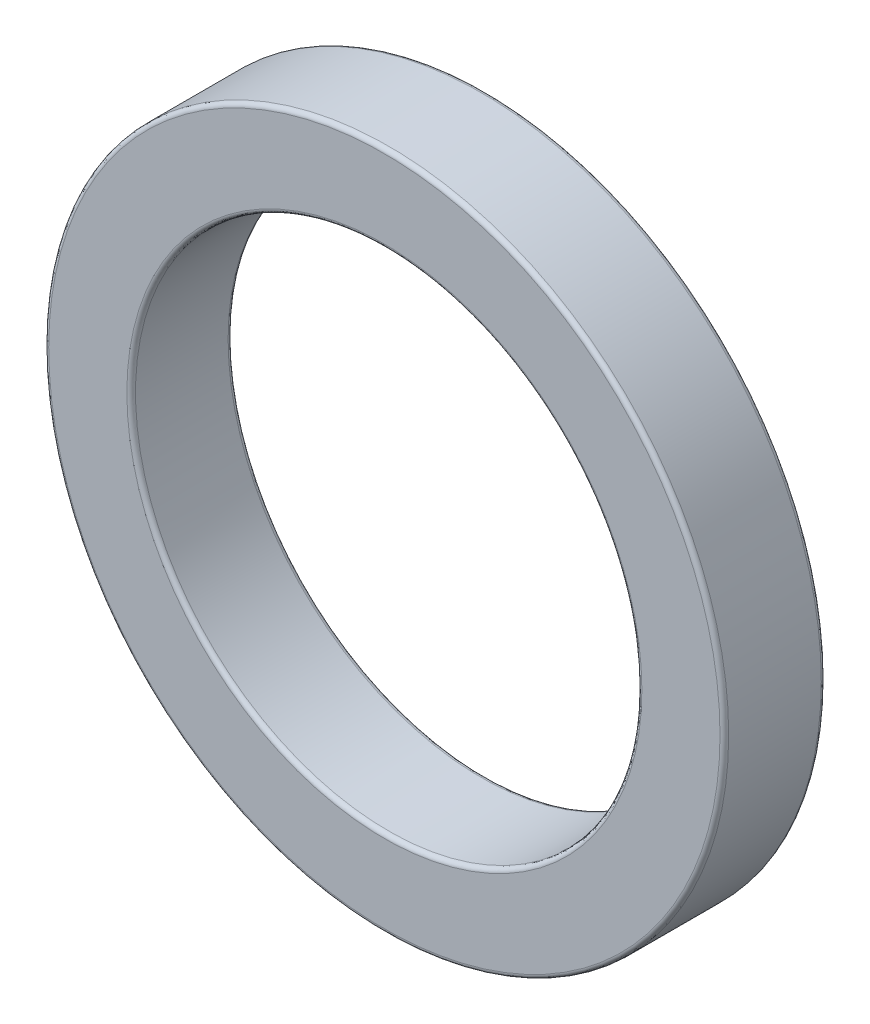
ISO-10303-21;
HEADER;
FILE_DESCRIPTION(('STEP AP214'),'2;1');
FILE_NAME('part.step','',(''),(''),'','','');
FILE_SCHEMA(('AUTOMOTIVE_DESIGN { 1 0 10303 214 1 1 1 1 }'));
ENDSEC;
DATA;
#1=APPLICATION_CONTEXT('core data for automotive mechanical design processes');
#2=APPLICATION_PROTOCOL_DEFINITION('international standard','automotive_design',2000,#1);
#3=PRODUCT_CONTEXT('',#1,'mechanical');
#4=PRODUCT('Part','Part','',(#3));
#5=PRODUCT_RELATED_PRODUCT_CATEGORY('part','',(#4));
#6=PRODUCT_DEFINITION_FORMATION('','',#4);
#7=PRODUCT_DEFINITION_CONTEXT('part definition',#1,'design');
#8=PRODUCT_DEFINITION('design','',#6,#7);
#9=PRODUCT_DEFINITION_SHAPE('','',#8);
#10=(LENGTH_UNIT() NAMED_UNIT(*) SI_UNIT(.MILLI.,.METRE.));
#11=(NAMED_UNIT(*) PLANE_ANGLE_UNIT() SI_UNIT($,.RADIAN.));
#12=(NAMED_UNIT(*) SI_UNIT($,.STERADIAN.) SOLID_ANGLE_UNIT());
#13=UNCERTAINTY_MEASURE_WITH_UNIT(LENGTH_MEASURE(1.E-05),#10,'distance_accuracy_value','');
#14=(GEOMETRIC_REPRESENTATION_CONTEXT(3) GLOBAL_UNCERTAINTY_ASSIGNED_CONTEXT((#13)) GLOBAL_UNIT_ASSIGNED_CONTEXT((#10,
#11,#12)) REPRESENTATION_CONTEXT('',''));
#15=CARTESIAN_POINT('',(0.,0.,0.));
#16=DIRECTION('',(0.,0.,1.));
#17=DIRECTION('',(1.,0.,0.));
#18=AXIS2_PLACEMENT_3D('',#15,#16,#17);
#19=CARTESIAN_POINT('',(23.5,0.,0.3));
#20=CARTESIAN_POINT('',(23.5,0.,0.124264068711928));
#21=CARTESIAN_POINT('',(23.3757359312881,0.,0.));
#22=CARTESIAN_POINT('',(23.2,0.,0.));
#23=(BOUNDED_CURVE() B_SPLINE_CURVE(3,(#19,#20,#21,#22),.UNSPECIFIED.,.F.,
.F.) B_SPLINE_CURVE_WITH_KNOTS((4,4),(0.,1.),
.UNSPECIFIED.) CURVE() GEOMETRIC_REPRESENTATION_ITEM() RATIONAL_B_SPLINE_CURVE((1.,
0.804737854124365,0.804737854124365,1.)) REPRESENTATION_ITEM(''));
#24=CARTESIAN_POINT('',(0.,0.,0.3));
#25=DIRECTION('',(0.,0.,1.));
#26=AXIS1_PLACEMENT('',#24,#25);
#27=SURFACE_OF_REVOLUTION('',#23,#26);
#28=CARTESIAN_POINT('',(0.,0.,0.3));
#29=DIRECTION('',(0.,0.,-1.));
#30=DIRECTION('',(-1.,0.,0.));
#31=AXIS2_PLACEMENT_3D('',#28,#29,#30);
#32=CIRCLE('',#31,23.5);
#33=CARTESIAN_POINT('',(-23.5,0.,0.3));
#34=VERTEX_POINT('',#33);
#35=EDGE_CURVE('E68',#34,#34,#32,.F.);
#36=ORIENTED_EDGE('',*,*,#35,.F.);
#37=EDGE_LOOP('',(#36));
#38=FACE_BOUND('',#37,.T.);
#39=CARTESIAN_POINT('',(0.,0.,0.));
#40=DIRECTION('',(0.,0.,1.));
#41=DIRECTION('',(1.,0.,0.));
#42=AXIS2_PLACEMENT_3D('',#39,#40,#41);
#43=CIRCLE('',#42,23.2);
#44=CARTESIAN_POINT('',(-23.2,0.,0.));
#45=VERTEX_POINT('',#44);
#46=CARTESIAN_POINT('',(23.2,0.,0.));
#47=VERTEX_POINT('',#46);
#48=EDGE_CURVE('E60',#45,#47,#43,.F.);
#49=ORIENTED_EDGE('',*,*,#48,.F.);
#50=CARTESIAN_POINT('',(0.,0.,0.));
#51=DIRECTION('',(0.,0.,1.));
#52=DIRECTION('',(-1.,0.,0.));
#53=AXIS2_PLACEMENT_3D('',#50,#51,#52);
#54=CIRCLE('',#53,23.2);
#55=EDGE_CURVE('E58',#47,#45,#54,.F.);
#56=ORIENTED_EDGE('',*,*,#55,.F.);
#57=EDGE_LOOP('',(#49,#56));
#58=FACE_BOUND('',#57,.T.);
#59=ADVANCED_FACE('F17',(#38,#58),#27,.F.);
#60=CARTESIAN_POINT('',(0.,0.,0.3));
#61=DIRECTION('',(0.,0.,-1.));
#62=DIRECTION('',(-1.,0.,0.));
#63=AXIS2_PLACEMENT_3D('',#60,#61,#62);
#64=CYLINDRICAL_SURFACE('',#63,23.5);
#65=CARTESIAN_POINT('',(0.,0.,6.7));
#66=DIRECTION('',(0.,0.,1.));
#67=DIRECTION('',(1.,0.,0.));
#68=AXIS2_PLACEMENT_3D('',#65,#66,#67);
#69=CIRCLE('',#68,23.5);
#70=CARTESIAN_POINT('',(23.5,0.,6.7));
#71=VERTEX_POINT('',#70);
#72=EDGE_CURVE('E298',#71,#71,#69,.T.);
#73=ORIENTED_EDGE('',*,*,#72,.F.);
#74=EDGE_LOOP('',(#73));
#75=FACE_BOUND('',#74,.T.);
#76=ORIENTED_EDGE('',*,*,#35,.T.);
#77=EDGE_LOOP('',(#76));
#78=FACE_BOUND('',#77,.T.);
#79=ADVANCED_FACE('F87',(#75,#78),#64,.T.);
#80=CARTESIAN_POINT('',(0.,0.,0.));
#81=DIRECTION('',(0.,0.,1.));
#82=DIRECTION('',(1.,0.,0.));
#83=AXIS2_PLACEMENT_3D('',#80,#81,#82);
#84=PLANE('',#83);
#85=CARTESIAN_POINT('',(0.,0.,0.));
#86=DIRECTION('',(0.,0.,-1.));
#87=DIRECTION('',(-1.,0.,0.));
#88=AXIS2_PLACEMENT_3D('',#85,#86,#87);
#89=CIRCLE('',#88,17.8);
#90=CARTESIAN_POINT('',(-17.8,0.,0.));
#91=VERTEX_POINT('',#90);
#92=CARTESIAN_POINT('',(17.8,0.,0.));
#93=VERTEX_POINT('',#92);
#94=EDGE_CURVE('E120',#91,#93,#89,.T.);
#95=ORIENTED_EDGE('',*,*,#94,.F.);
#96=CARTESIAN_POINT('',(0.,0.,0.));
#97=DIRECTION('',(0.,0.,-1.));
#98=DIRECTION('',(1.,0.,0.));
#99=AXIS2_PLACEMENT_3D('',#96,#97,#98);
#100=CIRCLE('',#99,17.8);
#101=EDGE_CURVE('E64',#91,#93,#100,.F.);
#102=ORIENTED_EDGE('',*,*,#101,.T.);
#103=EDGE_LOOP('',(#95,#102));
#104=FACE_BOUND('',#103,.T.);
#105=ORIENTED_EDGE('',*,*,#55,.T.);
#106=ORIENTED_EDGE('',*,*,#48,.T.);
#107=EDGE_LOOP('',(#105,#106));
#108=FACE_BOUND('',#107,.T.);
#109=ADVANCED_FACE('F67',(#104,#108),#84,.F.);
#110=CARTESIAN_POINT('',(23.2,0.,7.));
#111=CARTESIAN_POINT('',(23.3757359312881,0.,7.));
#112=CARTESIAN_POINT('',(23.5,0.,6.87573593128807));
#113=CARTESIAN_POINT('',(23.5,0.,6.7));
#114=(BOUNDED_CURVE() B_SPLINE_CURVE(3,(#110,#111,#112,#113),.UNSPECIFIED.,.F.,
.F.) B_SPLINE_CURVE_WITH_KNOTS((4,4),(0.,1.),
.UNSPECIFIED.) CURVE() GEOMETRIC_REPRESENTATION_ITEM() RATIONAL_B_SPLINE_CURVE((1.,
0.804737854124365,0.804737854124365,1.)) REPRESENTATION_ITEM(''));
#115=CARTESIAN_POINT('',(0.,0.,6.7));
#116=DIRECTION('',(0.,0.,1.));
#117=AXIS1_PLACEMENT('',#115,#116);
#118=SURFACE_OF_REVOLUTION('',#114,#117);
#119=ORIENTED_EDGE('',*,*,#72,.T.);
#120=EDGE_LOOP('',(#119));
#121=FACE_BOUND('',#120,.T.);
#122=CARTESIAN_POINT('',(0.,0.,7.));
#123=DIRECTION('',(0.,0.,-1.));
#124=DIRECTION('',(1.,0.,0.));
#125=AXIS2_PLACEMENT_3D('',#122,#123,#124);
#126=CIRCLE('',#125,23.2);
#127=CARTESIAN_POINT('',(-23.2,0.,7.));
#128=VERTEX_POINT('',#127);
#129=CARTESIAN_POINT('',(23.2,0.,7.));
#130=VERTEX_POINT('',#129);
#131=EDGE_CURVE('E158',#128,#130,#126,.F.);
#132=ORIENTED_EDGE('',*,*,#131,.F.);
#133=CARTESIAN_POINT('',(0.,0.,7.));
#134=DIRECTION('',(0.,0.,-1.));
#135=DIRECTION('',(-1.,0.,0.));
#136=AXIS2_PLACEMENT_3D('',#133,#134,#135);
#137=CIRCLE('',#136,23.2);
#138=EDGE_CURVE('E160',#130,#128,#137,.F.);
#139=ORIENTED_EDGE('',*,*,#138,.F.);
#140=EDGE_LOOP('',(#132,#139));
#141=FACE_BOUND('',#140,.T.);
#142=ADVANCED_FACE('F86',(#121,#141),#118,.F.);
#143=CARTESIAN_POINT('',(17.8,0.,0.));
#144=CARTESIAN_POINT('',(17.6242640687119,0.,0.));
#145=CARTESIAN_POINT('',(17.5,0.,0.124264068711925));
#146=CARTESIAN_POINT('',(17.5,0.,0.299999999999997));
#147=(BOUNDED_CURVE() B_SPLINE_CURVE(3,(#143,#144,#145,#146),.UNSPECIFIED.,.F.,
.F.) B_SPLINE_CURVE_WITH_KNOTS((4,4),(0.,1.),
.UNSPECIFIED.) CURVE() GEOMETRIC_REPRESENTATION_ITEM() RATIONAL_B_SPLINE_CURVE((1.,
0.804737854124365,0.804737854124365,1.)) REPRESENTATION_ITEM(''));
#148=CARTESIAN_POINT('',(0.,0.,0.3));
#149=DIRECTION('',(0.,0.,1.));
#150=AXIS1_PLACEMENT('',#148,#149);
#151=SURFACE_OF_REVOLUTION('',#147,#150);
#152=CARTESIAN_POINT('',(0.,0.,0.3));
#153=DIRECTION('',(0.,0.,-1.));
#154=DIRECTION('',(-1.,0.,0.));
#155=AXIS2_PLACEMENT_3D('',#152,#153,#154);
#156=CIRCLE('',#155,17.5);
#157=CARTESIAN_POINT('',(-17.5,0.,0.3));
#158=VERTEX_POINT('',#157);
#159=EDGE_CURVE('E206',#158,#158,#156,.T.);
#160=ORIENTED_EDGE('',*,*,#159,.F.);
#161=EDGE_LOOP('',(#160));
#162=FACE_BOUND('',#161,.T.);
#163=ORIENTED_EDGE('',*,*,#94,.T.);
#164=ORIENTED_EDGE('',*,*,#101,.F.);
#165=EDGE_LOOP('',(#163,#164));
#166=FACE_BOUND('',#165,.T.);
#167=ADVANCED_FACE('F124',(#162,#166),#151,.F.);
#168=CARTESIAN_POINT('',(0.,0.,7.));
#169=DIRECTION('',(0.,0.,1.));
#170=DIRECTION('',(1.,0.,0.));
#171=AXIS2_PLACEMENT_3D('',#168,#169,#170);
#172=PLANE('',#171);
#173=CARTESIAN_POINT('',(0.,0.,6.99999999999999));
#174=DIRECTION('',(0.,0.,1.));
#175=DIRECTION('',(-1.,0.,0.));
#176=AXIS2_PLACEMENT_3D('',#173,#174,#175);
#177=CIRCLE('',#176,17.8);
#178=CARTESIAN_POINT('',(17.8,0.,7.));
#179=VERTEX_POINT('',#178);
#180=CARTESIAN_POINT('',(-17.8,0.,7.));
#181=VERTEX_POINT('',#180);
#182=EDGE_CURVE('E37',#179,#181,#177,.F.);
#183=ORIENTED_EDGE('',*,*,#182,.T.);
#184=CARTESIAN_POINT('',(0.,0.,6.99999999999999));
#185=DIRECTION('',(0.,0.,1.));
#186=DIRECTION('',(1.,0.,0.));
#187=AXIS2_PLACEMENT_3D('',#184,#185,#186);
#188=CIRCLE('',#187,17.8);
#189=EDGE_CURVE('E29',#179,#181,#188,.T.);
#190=ORIENTED_EDGE('',*,*,#189,.F.);
#191=EDGE_LOOP('',(#183,#190));
#192=FACE_BOUND('',#191,.T.);
#193=ORIENTED_EDGE('',*,*,#138,.T.);
#194=ORIENTED_EDGE('',*,*,#131,.T.);
#195=EDGE_LOOP('',(#193,#194));
#196=FACE_BOUND('',#195,.T.);
#197=ADVANCED_FACE('F134',(#192,#196),#172,.T.);
#198=CARTESIAN_POINT('',(0.,0.,6.7));
#199=DIRECTION('',(0.,0.,-1.));
#200=DIRECTION('',(0.,1.,0.));
#201=AXIS2_PLACEMENT_3D('',#198,#199,#200);
#202=CYLINDRICAL_SURFACE('',#201,17.5);
#203=CARTESIAN_POINT('',(0.,0.,6.7));
#204=DIRECTION('',(0.,0.,1.));
#205=DIRECTION('',(1.,0.,0.));
#206=AXIS2_PLACEMENT_3D('',#203,#204,#205);
#207=CIRCLE('',#206,17.5);
#208=CARTESIAN_POINT('',(17.5,0.,6.7));
#209=VERTEX_POINT('',#208);
#210=EDGE_CURVE('E11',#209,#209,#207,.F.);
#211=ORIENTED_EDGE('',*,*,#210,.F.);
#212=EDGE_LOOP('',(#211));
#213=FACE_BOUND('',#212,.T.);
#214=ORIENTED_EDGE('',*,*,#159,.T.);
#215=EDGE_LOOP('',(#214));
#216=FACE_BOUND('',#215,.T.);
#217=ADVANCED_FACE('F226',(#213,#216),#202,.F.);
#218=CARTESIAN_POINT('',(17.5,0.,6.7));
#219=CARTESIAN_POINT('',(17.5,0.,6.87573593128807));
#220=CARTESIAN_POINT('',(17.6242640687119,0.,6.99999999999999));
#221=CARTESIAN_POINT('',(17.8,0.,6.99999999999999));
#222=(BOUNDED_CURVE() B_SPLINE_CURVE(3,(#218,#219,#220,#221),.UNSPECIFIED.,.F.,
.F.) B_SPLINE_CURVE_WITH_KNOTS((4,4),(0.,1.),
.UNSPECIFIED.) CURVE() GEOMETRIC_REPRESENTATION_ITEM() RATIONAL_B_SPLINE_CURVE((1.,
0.804737854124367,0.804737854124367,1.)) REPRESENTATION_ITEM(''));
#223=CARTESIAN_POINT('',(0.,0.,6.7));
#224=DIRECTION('',(0.,0.,1.));
#225=AXIS1_PLACEMENT('',#223,#224);
#226=SURFACE_OF_REVOLUTION('',#222,#225);
#227=ORIENTED_EDGE('',*,*,#189,.T.);
#228=ORIENTED_EDGE('',*,*,#182,.F.);
#229=EDGE_LOOP('',(#227,#228));
#230=FACE_BOUND('',#229,.T.);
#231=ORIENTED_EDGE('',*,*,#210,.T.);
#232=EDGE_LOOP('',(#231));
#233=FACE_BOUND('',#232,.T.);
#234=ADVANCED_FACE('F203',(#230,#233),#226,.F.);
#235=CLOSED_SHELL('',(#59,#79,#109,#142,#167,#197,#217,#234));
#236=MANIFOLD_SOLID_BREP('B1',#235);
#237=ADVANCED_BREP_SHAPE_REPRESENTATION('',(#18,#236),#14);
#238=SHAPE_DEFINITION_REPRESENTATION(#9,#237);
ENDSEC;
END-ISO-10303-21;
